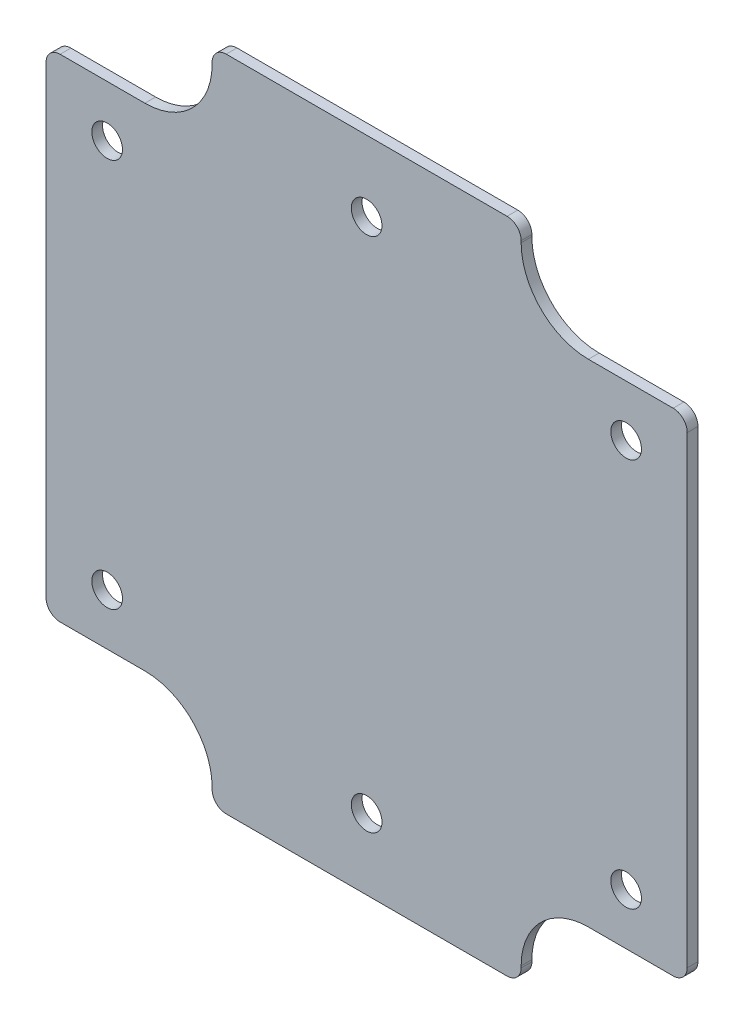
ISO-10303-21;
HEADER;
FILE_DESCRIPTION(('STEP AP214'),'2;1');
FILE_NAME('part.step','',(''),(''),'','','');
FILE_SCHEMA(('AUTOMOTIVE_DESIGN { 1 0 10303 214 1 1 1 1 }'));
ENDSEC;
DATA;
#1=APPLICATION_CONTEXT('core data for automotive mechanical design processes');
#2=APPLICATION_PROTOCOL_DEFINITION('international standard','automotive_design',2000,#1);
#3=PRODUCT_CONTEXT('',#1,'mechanical');
#4=PRODUCT('Part','Part','',(#3));
#5=PRODUCT_RELATED_PRODUCT_CATEGORY('part','',(#4));
#6=PRODUCT_DEFINITION_FORMATION('','',#4);
#7=PRODUCT_DEFINITION_CONTEXT('part definition',#1,'design');
#8=PRODUCT_DEFINITION('design','',#6,#7);
#9=PRODUCT_DEFINITION_SHAPE('','',#8);
#10=(LENGTH_UNIT() NAMED_UNIT(*) SI_UNIT(.MILLI.,.METRE.));
#11=(NAMED_UNIT(*) PLANE_ANGLE_UNIT() SI_UNIT($,.RADIAN.));
#12=(NAMED_UNIT(*) SI_UNIT($,.STERADIAN.) SOLID_ANGLE_UNIT());
#13=UNCERTAINTY_MEASURE_WITH_UNIT(LENGTH_MEASURE(1.E-05),#10,'distance_accuracy_value','');
#14=(GEOMETRIC_REPRESENTATION_CONTEXT(3) GLOBAL_UNCERTAINTY_ASSIGNED_CONTEXT((#13)) GLOBAL_UNIT_ASSIGNED_CONTEXT((#10,
#11,#12)) REPRESENTATION_CONTEXT('',''));
#15=CARTESIAN_POINT('',(0.,0.,0.));
#16=DIRECTION('',(0.,0.,1.));
#17=DIRECTION('',(1.,0.,0.));
#18=AXIS2_PLACEMENT_3D('',#15,#16,#17);
#19=CARTESIAN_POINT('',(0.,0.,1.2));
#20=DIRECTION('',(0.,0.,1.));
#21=DIRECTION('',(1.,0.,0.));
#22=AXIS2_PLACEMENT_3D('',#19,#20,#21);
#23=PLANE('',#22);
#24=CARTESIAN_POINT('',(35.8394,-28.8671,1.2));
#25=DIRECTION('',(0.,0.,1.));
#26=DIRECTION('',(1.,0.,0.));
#27=AXIS2_PLACEMENT_3D('',#24,#25,#26);
#28=CIRCLE('',#27,1.7145);
#29=CARTESIAN_POINT('',(37.5539,-28.8671,1.2));
#30=VERTEX_POINT('',#29);
#31=EDGE_CURVE('E526',#30,#30,#28,.T.);
#32=ORIENTED_EDGE('',*,*,#31,.F.);
#33=EDGE_LOOP('',(#32));
#34=FACE_BOUND('',#33,.T.);
#35=CARTESIAN_POINT('',(6.8326,21.7424,1.2));
#36=DIRECTION('',(0.,0.,1.));
#37=DIRECTION('',(1.,0.,0.));
#38=AXIS2_PLACEMENT_3D('',#35,#36,#37);
#39=CIRCLE('',#38,1.7145);
#40=CARTESIAN_POINT('',(8.5471,21.7424,1.2));
#41=VERTEX_POINT('',#40);
#42=EDGE_CURVE('E514',#41,#41,#39,.T.);
#43=ORIENTED_EDGE('',*,*,#42,.F.);
#44=EDGE_LOOP('',(#43));
#45=FACE_BOUND('',#44,.T.);
#46=CARTESIAN_POINT('',(64.8462,-21.7424,1.2));
#47=DIRECTION('',(0.,0.,1.));
#48=DIRECTION('',(1.,0.,0.));
#49=AXIS2_PLACEMENT_3D('',#46,#47,#48);
#50=CIRCLE('',#49,1.7145);
#51=CARTESIAN_POINT('',(66.5607,-21.7424,1.2));
#52=VERTEX_POINT('',#51);
#53=EDGE_CURVE('E226',#52,#52,#50,.T.);
#54=ORIENTED_EDGE('',*,*,#53,.F.);
#55=EDGE_LOOP('',(#54));
#56=FACE_BOUND('',#55,.T.);
#57=DIRECTION('',(0.,-1.,0.));
#58=VECTOR('',#57,1.);
#59=CARTESIAN_POINT('',(18.5674,-36.7792,1.2));
#60=LINE('',#59,#58);
#61=CARTESIAN_POINT('',(18.5674,-35.0012,1.2));
#62=VERTEX_POINT('',#61);
#63=CARTESIAN_POINT('',(18.5674,-35.2044,1.2));
#64=VERTEX_POINT('',#63);
#65=EDGE_CURVE('E386',#62,#64,#60,.T.);
#66=ORIENTED_EDGE('',*,*,#65,.T.);
#67=CARTESIAN_POINT('',(20.1422,-35.2044,1.2));
#68=DIRECTION('',(0.,0.,1.));
#69=DIRECTION('',(1.,0.,0.));
#70=AXIS2_PLACEMENT_3D('',#67,#68,#69);
#71=CIRCLE('',#70,1.5748);
#72=CARTESIAN_POINT('',(20.1422,-36.7792,1.2));
#73=VERTEX_POINT('',#72);
#74=EDGE_CURVE('E330',#64,#73,#71,.T.);
#75=ORIENTED_EDGE('',*,*,#74,.T.);
#76=DIRECTION('',(1.,0.,0.));
#77=VECTOR('',#76,1.);
#78=CARTESIAN_POINT('',(53.1114,-36.7792,1.2));
#79=LINE('',#78,#77);
#80=CARTESIAN_POINT('',(51.5366,-36.7792,1.2));
#81=VERTEX_POINT('',#80);
#82=EDGE_CURVE('E388',#73,#81,#79,.T.);
#83=ORIENTED_EDGE('',*,*,#82,.T.);
#84=CARTESIAN_POINT('',(51.5366,-35.2044,1.2));
#85=DIRECTION('',(0.,0.,1.));
#86=DIRECTION('',(1.,0.,0.));
#87=AXIS2_PLACEMENT_3D('',#84,#85,#86);
#88=CIRCLE('',#87,1.5748);
#89=CARTESIAN_POINT('',(53.1114,-35.2044,1.2));
#90=VERTEX_POINT('',#89);
#91=EDGE_CURVE('E328',#81,#90,#88,.T.);
#92=ORIENTED_EDGE('',*,*,#91,.T.);
#93=DIRECTION('',(0.,1.,0.));
#94=VECTOR('',#93,1.);
#95=CARTESIAN_POINT('',(53.1114,-27.4828,1.2));
#96=LINE('',#95,#94);
#97=CARTESIAN_POINT('',(53.1114,-35.0012,1.2));
#98=VERTEX_POINT('',#97);
#99=EDGE_CURVE('E218',#90,#98,#96,.T.);
#100=ORIENTED_EDGE('',*,*,#99,.T.);
#101=CARTESIAN_POINT('',(60.6298,-35.0012,1.2));
#102=DIRECTION('',(0.,0.,1.));
#103=DIRECTION('',(1.,0.,0.));
#104=AXIS2_PLACEMENT_3D('',#101,#102,#103);
#105=CIRCLE('',#104,7.5184);
#106=CARTESIAN_POINT('',(60.6298,-27.4828,1.2));
#107=VERTEX_POINT('',#106);
#108=EDGE_CURVE('E207',#98,#107,#105,.F.);
#109=ORIENTED_EDGE('',*,*,#108,.T.);
#110=DIRECTION('',(1.,0.,0.));
#111=VECTOR('',#110,1.);
#112=CARTESIAN_POINT('',(71.6788,-27.4828,1.2));
#113=LINE('',#112,#111);
#114=CARTESIAN_POINT('',(70.104,-27.4828,1.2));
#115=VERTEX_POINT('',#114);
#116=EDGE_CURVE('E217',#107,#115,#113,.T.);
#117=ORIENTED_EDGE('',*,*,#116,.T.);
#118=CARTESIAN_POINT('',(70.104,-25.908,1.2));
#119=DIRECTION('',(0.,0.,1.));
#120=DIRECTION('',(1.,0.,0.));
#121=AXIS2_PLACEMENT_3D('',#118,#119,#120);
#122=CIRCLE('',#121,1.5748);
#123=CARTESIAN_POINT('',(71.6788,-25.908,1.2));
#124=VERTEX_POINT('',#123);
#125=EDGE_CURVE('E326',#115,#124,#122,.T.);
#126=ORIENTED_EDGE('',*,*,#125,.T.);
#127=DIRECTION('',(0.,1.,0.));
#128=VECTOR('',#127,1.);
#129=CARTESIAN_POINT('',(71.6788,-27.4828,1.2));
#130=LINE('',#129,#128);
#131=CARTESIAN_POINT('',(71.6788,25.908,1.2));
#132=VERTEX_POINT('',#131);
#133=EDGE_CURVE('E504',#124,#132,#130,.T.);
#134=ORIENTED_EDGE('',*,*,#133,.T.);
#135=CARTESIAN_POINT('',(70.104,25.908,1.2));
#136=DIRECTION('',(0.,0.,1.));
#137=DIRECTION('',(1.,0.,0.));
#138=AXIS2_PLACEMENT_3D('',#135,#136,#137);
#139=CIRCLE('',#138,1.5748);
#140=CARTESIAN_POINT('',(70.104,27.4828,1.2));
#141=VERTEX_POINT('',#140);
#142=EDGE_CURVE('E324',#132,#141,#139,.T.);
#143=ORIENTED_EDGE('',*,*,#142,.T.);
#144=DIRECTION('',(-1.,0.,0.));
#145=VECTOR('',#144,1.);
#146=CARTESIAN_POINT('',(71.6788,27.4828,1.2));
#147=LINE('',#146,#145);
#148=CARTESIAN_POINT('',(60.6298,27.4828,1.2));
#149=VERTEX_POINT('',#148);
#150=EDGE_CURVE('E500',#141,#149,#147,.T.);
#151=ORIENTED_EDGE('',*,*,#150,.T.);
#152=CARTESIAN_POINT('',(60.6298,35.0012,1.2));
#153=DIRECTION('',(0.,0.,1.));
#154=DIRECTION('',(1.,0.,0.));
#155=AXIS2_PLACEMENT_3D('',#152,#153,#154);
#156=CIRCLE('',#155,7.5184);
#157=CARTESIAN_POINT('',(53.1114,35.0012,1.2));
#158=VERTEX_POINT('',#157);
#159=EDGE_CURVE('E288',#149,#158,#156,.F.);
#160=ORIENTED_EDGE('',*,*,#159,.T.);
#161=DIRECTION('',(0.,1.,0.));
#162=VECTOR('',#161,1.);
#163=CARTESIAN_POINT('',(53.1114,27.4828,1.2));
#164=LINE('',#163,#162);
#165=CARTESIAN_POINT('',(53.1114,35.2044,1.2));
#166=VERTEX_POINT('',#165);
#167=EDGE_CURVE('E497',#158,#166,#164,.T.);
#168=ORIENTED_EDGE('',*,*,#167,.T.);
#169=CARTESIAN_POINT('',(51.5366,35.2044,1.2));
#170=DIRECTION('',(0.,0.,1.));
#171=DIRECTION('',(1.,0.,0.));
#172=AXIS2_PLACEMENT_3D('',#169,#170,#171);
#173=CIRCLE('',#172,1.5748);
#174=CARTESIAN_POINT('',(51.5366,36.7792,1.2));
#175=VERTEX_POINT('',#174);
#176=EDGE_CURVE('E322',#166,#175,#173,.T.);
#177=ORIENTED_EDGE('',*,*,#176,.T.);
#178=DIRECTION('',(-1.,0.,0.));
#179=VECTOR('',#178,1.);
#180=CARTESIAN_POINT('',(53.1114,36.7792,1.2));
#181=LINE('',#180,#179);
#182=CARTESIAN_POINT('',(20.1422,36.7792,1.2));
#183=VERTEX_POINT('',#182);
#184=EDGE_CURVE('E493',#175,#183,#181,.T.);
#185=ORIENTED_EDGE('',*,*,#184,.T.);
#186=CARTESIAN_POINT('',(20.1422,35.2044,1.2));
#187=DIRECTION('',(0.,0.,1.));
#188=DIRECTION('',(1.,0.,0.));
#189=AXIS2_PLACEMENT_3D('',#186,#187,#188);
#190=CIRCLE('',#189,1.5748);
#191=CARTESIAN_POINT('',(18.5674,35.2044,1.2));
#192=VERTEX_POINT('',#191);
#193=EDGE_CURVE('E320',#183,#192,#190,.T.);
#194=ORIENTED_EDGE('',*,*,#193,.T.);
#195=DIRECTION('',(0.,-1.,0.));
#196=VECTOR('',#195,1.);
#197=CARTESIAN_POINT('',(18.5674,36.7792,1.2));
#198=LINE('',#197,#196);
#199=CARTESIAN_POINT('',(18.5674,35.0012,1.2));
#200=VERTEX_POINT('',#199);
#201=EDGE_CURVE('E372',#192,#200,#198,.T.);
#202=ORIENTED_EDGE('',*,*,#201,.T.);
#203=CARTESIAN_POINT('',(11.049,35.0012,1.2));
#204=DIRECTION('',(0.,0.,1.));
#205=DIRECTION('',(1.,0.,0.));
#206=AXIS2_PLACEMENT_3D('',#203,#204,#205);
#207=CIRCLE('',#206,7.5184);
#208=CARTESIAN_POINT('',(11.049,27.4828,1.2));
#209=VERTEX_POINT('',#208);
#210=EDGE_CURVE('E293',#200,#209,#207,.F.);
#211=ORIENTED_EDGE('',*,*,#210,.T.);
#212=DIRECTION('',(-1.,0.,0.));
#213=VECTOR('',#212,1.);
#214=CARTESIAN_POINT('',(18.5674,27.4828,1.2));
#215=LINE('',#214,#213);
#216=CARTESIAN_POINT('',(1.5748,27.4828,1.2));
#217=VERTEX_POINT('',#216);
#218=EDGE_CURVE('E363',#209,#217,#215,.T.);
#219=ORIENTED_EDGE('',*,*,#218,.T.);
#220=CARTESIAN_POINT('',(1.5748,25.908,1.2));
#221=DIRECTION('',(0.,0.,1.));
#222=DIRECTION('',(1.,0.,0.));
#223=AXIS2_PLACEMENT_3D('',#220,#221,#222);
#224=CIRCLE('',#223,1.5748);
#225=CARTESIAN_POINT('',(0.,25.908,1.2));
#226=VERTEX_POINT('',#225);
#227=EDGE_CURVE('E318',#217,#226,#224,.T.);
#228=ORIENTED_EDGE('',*,*,#227,.T.);
#229=DIRECTION('',(0.,-1.,0.));
#230=VECTOR('',#229,1.);
#231=CARTESIAN_POINT('',(0.,-27.4828,1.2));
#232=LINE('',#231,#230);
#233=CARTESIAN_POINT('',(0.,-25.908,1.2));
#234=VERTEX_POINT('',#233);
#235=EDGE_CURVE('E371',#226,#234,#232,.T.);
#236=ORIENTED_EDGE('',*,*,#235,.T.);
#237=CARTESIAN_POINT('',(1.5748,-25.908,1.2));
#238=DIRECTION('',(0.,0.,1.));
#239=DIRECTION('',(1.,0.,0.));
#240=AXIS2_PLACEMENT_3D('',#237,#238,#239);
#241=CIRCLE('',#240,1.5748);
#242=CARTESIAN_POINT('',(1.5748,-27.4828,1.2));
#243=VERTEX_POINT('',#242);
#244=EDGE_CURVE('E48',#234,#243,#241,.T.);
#245=ORIENTED_EDGE('',*,*,#244,.T.);
#246=DIRECTION('',(1.,0.,0.));
#247=VECTOR('',#246,1.);
#248=CARTESIAN_POINT('',(18.5674,-27.4828,1.2));
#249=LINE('',#248,#247);
#250=CARTESIAN_POINT('',(11.049,-27.4828,1.2));
#251=VERTEX_POINT('',#250);
#252=EDGE_CURVE('E383',#243,#251,#249,.T.);
#253=ORIENTED_EDGE('',*,*,#252,.T.);
#254=CARTESIAN_POINT('',(11.049,-35.0012,1.2));
#255=DIRECTION('',(0.,0.,1.));
#256=DIRECTION('',(1.,0.,0.));
#257=AXIS2_PLACEMENT_3D('',#254,#255,#256);
#258=CIRCLE('',#257,7.5184);
#259=EDGE_CURVE('E283',#251,#62,#258,.F.);
#260=ORIENTED_EDGE('',*,*,#259,.T.);
#261=EDGE_LOOP('',(#66,#75,#83,#92,#100,#109,#117,#126,#134,#143,#151,#160,#168,#177,#185,#194,
#202,#211,#219,#228,#236,#245,#253,#260));
#262=FACE_BOUND('',#261,.T.);
#263=CARTESIAN_POINT('',(6.83260000000001,-21.7424,1.2));
#264=DIRECTION('',(0.,0.,1.));
#265=DIRECTION('',(-1.,0.,0.));
#266=AXIS2_PLACEMENT_3D('',#263,#264,#265);
#267=CIRCLE('',#266,1.7145);
#268=CARTESIAN_POINT('',(5.11810000000001,-21.7424,1.2));
#269=VERTEX_POINT('',#268);
#270=EDGE_CURVE('E509',#269,#269,#267,.T.);
#271=ORIENTED_EDGE('',*,*,#270,.F.);
#272=EDGE_LOOP('',(#271));
#273=FACE_BOUND('',#272,.T.);
#274=CARTESIAN_POINT('',(64.8462,21.7424,1.2));
#275=DIRECTION('',(0.,0.,1.));
#276=DIRECTION('',(-1.,0.,0.));
#277=AXIS2_PLACEMENT_3D('',#274,#275,#276);
#278=CIRCLE('',#277,1.7145);
#279=CARTESIAN_POINT('',(63.1317,21.7424,1.2));
#280=VERTEX_POINT('',#279);
#281=EDGE_CURVE('E520',#280,#280,#278,.T.);
#282=ORIENTED_EDGE('',*,*,#281,.F.);
#283=EDGE_LOOP('',(#282));
#284=FACE_BOUND('',#283,.T.);
#285=CARTESIAN_POINT('',(35.8394,28.8671,1.2));
#286=DIRECTION('',(0.,0.,1.));
#287=DIRECTION('',(-1.,0.,0.));
#288=AXIS2_PLACEMENT_3D('',#285,#286,#287);
#289=CIRCLE('',#288,1.7145);
#290=CARTESIAN_POINT('',(34.1249,28.8671,1.2));
#291=VERTEX_POINT('',#290);
#292=EDGE_CURVE('E532',#291,#291,#289,.T.);
#293=ORIENTED_EDGE('',*,*,#292,.F.);
#294=EDGE_LOOP('',(#293));
#295=FACE_BOUND('',#294,.T.);
#296=ADVANCED_FACE('F33',(#34,#45,#56,#262,#273,#284,#295),#23,.T.);
#297=CARTESIAN_POINT('',(0.,0.,0.));
#298=DIRECTION('',(0.,0.,1.));
#299=DIRECTION('',(1.,0.,0.));
#300=AXIS2_PLACEMENT_3D('',#297,#298,#299);
#301=PLANE('',#300);
#302=DIRECTION('',(1.,0.,0.));
#303=VECTOR('',#302,1.);
#304=CARTESIAN_POINT('',(53.1114,-36.7792,0.));
#305=LINE('',#304,#303);
#306=CARTESIAN_POINT('',(20.1422,-36.7792,0.));
#307=VERTEX_POINT('',#306);
#308=CARTESIAN_POINT('',(51.5366,-36.7792,0.));
#309=VERTEX_POINT('',#308);
#310=EDGE_CURVE('E256',#307,#309,#305,.T.);
#311=ORIENTED_EDGE('',*,*,#310,.F.);
#312=CARTESIAN_POINT('',(20.1422,-35.2044,0.));
#313=DIRECTION('',(0.,0.,1.));
#314=DIRECTION('',(1.,0.,0.));
#315=AXIS2_PLACEMENT_3D('',#312,#313,#314);
#316=CIRCLE('',#315,1.5748);
#317=CARTESIAN_POINT('',(18.5674,-35.2044,0.));
#318=VERTEX_POINT('',#317);
#319=EDGE_CURVE('E313',#307,#318,#316,.F.);
#320=ORIENTED_EDGE('',*,*,#319,.T.);
#321=DIRECTION('',(0.,-1.,0.));
#322=VECTOR('',#321,1.);
#323=CARTESIAN_POINT('',(18.5674,-36.7792,0.));
#324=LINE('',#323,#322);
#325=CARTESIAN_POINT('',(18.5674,-35.0012,0.));
#326=VERTEX_POINT('',#325);
#327=EDGE_CURVE('E253',#326,#318,#324,.T.);
#328=ORIENTED_EDGE('',*,*,#327,.F.);
#329=CARTESIAN_POINT('',(11.049,-35.0012,0.));
#330=DIRECTION('',(0.,0.,1.));
#331=DIRECTION('',(1.,0.,0.));
#332=AXIS2_PLACEMENT_3D('',#329,#330,#331);
#333=CIRCLE('',#332,7.5184);
#334=CARTESIAN_POINT('',(11.049,-27.4828,0.));
#335=VERTEX_POINT('',#334);
#336=EDGE_CURVE('E280',#326,#335,#333,.T.);
#337=ORIENTED_EDGE('',*,*,#336,.T.);
#338=DIRECTION('',(1.,0.,0.));
#339=VECTOR('',#338,1.);
#340=CARTESIAN_POINT('',(18.5674,-27.4828,0.));
#341=LINE('',#340,#339);
#342=CARTESIAN_POINT('',(1.5748,-27.4828,0.));
#343=VERTEX_POINT('',#342);
#344=EDGE_CURVE('E251',#343,#335,#341,.T.);
#345=ORIENTED_EDGE('',*,*,#344,.F.);
#346=CARTESIAN_POINT('',(1.5748,-25.908,0.));
#347=DIRECTION('',(0.,0.,1.));
#348=DIRECTION('',(1.,0.,0.));
#349=AXIS2_PLACEMENT_3D('',#346,#347,#348);
#350=CIRCLE('',#349,1.5748);
#351=CARTESIAN_POINT('',(0.,-25.908,0.));
#352=VERTEX_POINT('',#351);
#353=EDGE_CURVE('E300',#343,#352,#350,.F.);
#354=ORIENTED_EDGE('',*,*,#353,.T.);
#355=DIRECTION('',(0.,-1.,0.));
#356=VECTOR('',#355,1.);
#357=CARTESIAN_POINT('',(0.,-27.4828,0.));
#358=LINE('',#357,#356);
#359=CARTESIAN_POINT('',(0.,25.908,0.));
#360=VERTEX_POINT('',#359);
#361=EDGE_CURVE('E249',#360,#352,#358,.T.);
#362=ORIENTED_EDGE('',*,*,#361,.F.);
#363=CARTESIAN_POINT('',(1.5748,25.908,0.));
#364=DIRECTION('',(0.,0.,1.));
#365=DIRECTION('',(1.,0.,0.));
#366=AXIS2_PLACEMENT_3D('',#363,#364,#365);
#367=CIRCLE('',#366,1.5748);
#368=CARTESIAN_POINT('',(1.5748,27.4828,0.));
#369=VERTEX_POINT('',#368);
#370=EDGE_CURVE('E302',#360,#369,#367,.F.);
#371=ORIENTED_EDGE('',*,*,#370,.T.);
#372=DIRECTION('',(-1.,0.,0.));
#373=VECTOR('',#372,1.);
#374=CARTESIAN_POINT('',(18.5674,27.4828,0.));
#375=LINE('',#374,#373);
#376=CARTESIAN_POINT('',(11.049,27.4828,0.));
#377=VERTEX_POINT('',#376);
#378=EDGE_CURVE('E246',#377,#369,#375,.T.);
#379=ORIENTED_EDGE('',*,*,#378,.F.);
#380=CARTESIAN_POINT('',(11.049,35.0012,0.));
#381=DIRECTION('',(0.,0.,1.));
#382=DIRECTION('',(1.,0.,0.));
#383=AXIS2_PLACEMENT_3D('',#380,#381,#382);
#384=CIRCLE('',#383,7.5184);
#385=CARTESIAN_POINT('',(18.5674,35.0012,0.));
#386=VERTEX_POINT('',#385);
#387=EDGE_CURVE('E290',#377,#386,#384,.T.);
#388=ORIENTED_EDGE('',*,*,#387,.T.);
#389=DIRECTION('',(0.,-1.,0.));
#390=VECTOR('',#389,1.);
#391=CARTESIAN_POINT('',(18.5674,36.7792,0.));
#392=LINE('',#391,#390);
#393=CARTESIAN_POINT('',(18.5674,35.2044,0.));
#394=VERTEX_POINT('',#393);
#395=EDGE_CURVE('E244',#394,#386,#392,.T.);
#396=ORIENTED_EDGE('',*,*,#395,.F.);
#397=CARTESIAN_POINT('',(20.1422,35.2044,0.));
#398=DIRECTION('',(0.,0.,1.));
#399=DIRECTION('',(1.,0.,0.));
#400=AXIS2_PLACEMENT_3D('',#397,#398,#399);
#401=CIRCLE('',#400,1.5748);
#402=CARTESIAN_POINT('',(20.1422,36.7792,0.));
#403=VERTEX_POINT('',#402);
#404=EDGE_CURVE('E304',#394,#403,#401,.F.);
#405=ORIENTED_EDGE('',*,*,#404,.T.);
#406=DIRECTION('',(-1.,0.,0.));
#407=VECTOR('',#406,1.);
#408=CARTESIAN_POINT('',(53.1114,36.7792,0.));
#409=LINE('',#408,#407);
#410=CARTESIAN_POINT('',(51.5366,36.7792,0.));
#411=VERTEX_POINT('',#410);
#412=EDGE_CURVE('E241',#411,#403,#409,.T.);
#413=ORIENTED_EDGE('',*,*,#412,.F.);
#414=CARTESIAN_POINT('',(51.5366,35.2044,0.));
#415=DIRECTION('',(0.,0.,1.));
#416=DIRECTION('',(1.,0.,0.));
#417=AXIS2_PLACEMENT_3D('',#414,#415,#416);
#418=CIRCLE('',#417,1.5748);
#419=CARTESIAN_POINT('',(53.1114,35.2044,0.));
#420=VERTEX_POINT('',#419);
#421=EDGE_CURVE('E306',#411,#420,#418,.F.);
#422=ORIENTED_EDGE('',*,*,#421,.T.);
#423=DIRECTION('',(0.,1.,0.));
#424=VECTOR('',#423,1.);
#425=CARTESIAN_POINT('',(53.1114,27.4828,0.));
#426=LINE('',#425,#424);
#427=CARTESIAN_POINT('',(53.1114,35.0012,0.));
#428=VERTEX_POINT('',#427);
#429=EDGE_CURVE('E238',#428,#420,#426,.T.);
#430=ORIENTED_EDGE('',*,*,#429,.F.);
#431=CARTESIAN_POINT('',(60.6298,35.0012,0.));
#432=DIRECTION('',(0.,0.,1.));
#433=DIRECTION('',(1.,0.,0.));
#434=AXIS2_PLACEMENT_3D('',#431,#432,#433);
#435=CIRCLE('',#434,7.5184);
#436=CARTESIAN_POINT('',(60.6298,27.4828,0.));
#437=VERTEX_POINT('',#436);
#438=EDGE_CURVE('E285',#428,#437,#435,.T.);
#439=ORIENTED_EDGE('',*,*,#438,.T.);
#440=DIRECTION('',(-1.,0.,0.));
#441=VECTOR('',#440,1.);
#442=CARTESIAN_POINT('',(71.6788,27.4828,0.));
#443=LINE('',#442,#441);
#444=CARTESIAN_POINT('',(70.104,27.4828,0.));
#445=VERTEX_POINT('',#444);
#446=EDGE_CURVE('E229',#445,#437,#443,.T.);
#447=ORIENTED_EDGE('',*,*,#446,.F.);
#448=CARTESIAN_POINT('',(70.104,25.908,0.));
#449=DIRECTION('',(0.,0.,1.));
#450=DIRECTION('',(1.,0.,0.));
#451=AXIS2_PLACEMENT_3D('',#448,#449,#450);
#452=CIRCLE('',#451,1.5748);
#453=CARTESIAN_POINT('',(71.6788,25.908,0.));
#454=VERTEX_POINT('',#453);
#455=EDGE_CURVE('E308',#445,#454,#452,.F.);
#456=ORIENTED_EDGE('',*,*,#455,.T.);
#457=DIRECTION('',(0.,1.,0.));
#458=VECTOR('',#457,1.);
#459=CARTESIAN_POINT('',(71.6788,-27.4828,0.));
#460=LINE('',#459,#458);
#461=CARTESIAN_POINT('',(71.6788,-25.908,0.));
#462=VERTEX_POINT('',#461);
#463=EDGE_CURVE('E225',#462,#454,#460,.T.);
#464=ORIENTED_EDGE('',*,*,#463,.F.);
#465=CARTESIAN_POINT('',(70.104,-25.908,0.));
#466=DIRECTION('',(0.,0.,1.));
#467=DIRECTION('',(1.,0.,0.));
#468=AXIS2_PLACEMENT_3D('',#465,#466,#467);
#469=CIRCLE('',#468,1.5748);
#470=CARTESIAN_POINT('',(70.104,-27.4828,0.));
#471=VERTEX_POINT('',#470);
#472=EDGE_CURVE('E224',#462,#471,#469,.F.);
#473=ORIENTED_EDGE('',*,*,#472,.T.);
#474=DIRECTION('',(1.,0.,0.));
#475=VECTOR('',#474,1.);
#476=CARTESIAN_POINT('',(71.6788,-27.4828,0.));
#477=LINE('',#476,#475);
#478=CARTESIAN_POINT('',(60.6298,-27.4828,0.));
#479=VERTEX_POINT('',#478);
#480=EDGE_CURVE('E214',#479,#471,#477,.T.);
#481=ORIENTED_EDGE('',*,*,#480,.F.);
#482=CARTESIAN_POINT('',(60.6298,-35.0012,0.));
#483=DIRECTION('',(0.,0.,1.));
#484=DIRECTION('',(1.,0.,0.));
#485=AXIS2_PLACEMENT_3D('',#482,#483,#484);
#486=CIRCLE('',#485,7.5184);
#487=CARTESIAN_POINT('',(53.1114,-35.0012,0.));
#488=VERTEX_POINT('',#487);
#489=EDGE_CURVE('E197',#479,#488,#486,.T.);
#490=ORIENTED_EDGE('',*,*,#489,.T.);
#491=DIRECTION('',(0.,1.,0.));
#492=VECTOR('',#491,1.);
#493=CARTESIAN_POINT('',(53.1114,-27.4828,0.));
#494=LINE('',#493,#492);
#495=CARTESIAN_POINT('',(53.1114,-35.2044,0.));
#496=VERTEX_POINT('',#495);
#497=EDGE_CURVE('E259',#496,#488,#494,.T.);
#498=ORIENTED_EDGE('',*,*,#497,.F.);
#499=CARTESIAN_POINT('',(51.5366,-35.2044,0.));
#500=DIRECTION('',(0.,0.,1.));
#501=DIRECTION('',(1.,0.,0.));
#502=AXIS2_PLACEMENT_3D('',#499,#500,#501);
#503=CIRCLE('',#502,1.5748);
#504=EDGE_CURVE('E311',#496,#309,#503,.F.);
#505=ORIENTED_EDGE('',*,*,#504,.T.);
#506=EDGE_LOOP('',(#311,#320,#328,#337,#345,#354,#362,#371,#379,#388,#396,#405,#413,#422,#430,
#439,#447,#456,#464,#473,#481,#490,#498,#505));
#507=FACE_BOUND('',#506,.T.);
#508=CARTESIAN_POINT('',(64.8462,-21.7424,0.));
#509=DIRECTION('',(0.,0.,1.));
#510=DIRECTION('',(1.,0.,0.));
#511=AXIS2_PLACEMENT_3D('',#508,#509,#510);
#512=CIRCLE('',#511,1.7145);
#513=CARTESIAN_POINT('',(66.5607,-21.7424,0.));
#514=VERTEX_POINT('',#513);
#515=EDGE_CURVE('E232',#514,#514,#512,.T.);
#516=ORIENTED_EDGE('',*,*,#515,.T.);
#517=EDGE_LOOP('',(#516));
#518=FACE_BOUND('',#517,.T.);
#519=CARTESIAN_POINT('',(6.83260000000001,-21.7424,0.));
#520=DIRECTION('',(0.,0.,1.));
#521=DIRECTION('',(-1.,0.,0.));
#522=AXIS2_PLACEMENT_3D('',#519,#520,#521);
#523=CIRCLE('',#522,1.7145);
#524=CARTESIAN_POINT('',(5.11810000000001,-21.7424,0.));
#525=VERTEX_POINT('',#524);
#526=EDGE_CURVE('E511',#525,#525,#523,.T.);
#527=ORIENTED_EDGE('',*,*,#526,.T.);
#528=EDGE_LOOP('',(#527));
#529=FACE_BOUND('',#528,.T.);
#530=CARTESIAN_POINT('',(6.8326,21.7424,0.));
#531=DIRECTION('',(0.,0.,1.));
#532=DIRECTION('',(1.,0.,0.));
#533=AXIS2_PLACEMENT_3D('',#530,#531,#532);
#534=CIRCLE('',#533,1.7145);
#535=CARTESIAN_POINT('',(8.5471,21.7424,0.));
#536=VERTEX_POINT('',#535);
#537=EDGE_CURVE('E517',#536,#536,#534,.T.);
#538=ORIENTED_EDGE('',*,*,#537,.T.);
#539=EDGE_LOOP('',(#538));
#540=FACE_BOUND('',#539,.T.);
#541=CARTESIAN_POINT('',(64.8462,21.7424,0.));
#542=DIRECTION('',(0.,0.,1.));
#543=DIRECTION('',(-1.,0.,0.));
#544=AXIS2_PLACEMENT_3D('',#541,#542,#543);
#545=CIRCLE('',#544,1.7145);
#546=CARTESIAN_POINT('',(63.1317,21.7424,0.));
#547=VERTEX_POINT('',#546);
#548=EDGE_CURVE('E523',#547,#547,#545,.T.);
#549=ORIENTED_EDGE('',*,*,#548,.T.);
#550=EDGE_LOOP('',(#549));
#551=FACE_BOUND('',#550,.T.);
#552=CARTESIAN_POINT('',(35.8394,-28.8671,0.));
#553=DIRECTION('',(0.,0.,1.));
#554=DIRECTION('',(1.,0.,0.));
#555=AXIS2_PLACEMENT_3D('',#552,#553,#554);
#556=CIRCLE('',#555,1.7145);
#557=CARTESIAN_POINT('',(37.5539,-28.8671,0.));
#558=VERTEX_POINT('',#557);
#559=EDGE_CURVE('E529',#558,#558,#556,.T.);
#560=ORIENTED_EDGE('',*,*,#559,.T.);
#561=EDGE_LOOP('',(#560));
#562=FACE_BOUND('',#561,.T.);
#563=CARTESIAN_POINT('',(35.8394,28.8671,0.));
#564=DIRECTION('',(0.,0.,1.));
#565=DIRECTION('',(-1.,0.,0.));
#566=AXIS2_PLACEMENT_3D('',#563,#564,#565);
#567=CIRCLE('',#566,1.7145);
#568=CARTESIAN_POINT('',(34.1249,28.8671,0.));
#569=VERTEX_POINT('',#568);
#570=EDGE_CURVE('E535',#569,#569,#567,.T.);
#571=ORIENTED_EDGE('',*,*,#570,.T.);
#572=EDGE_LOOP('',(#571));
#573=FACE_BOUND('',#572,.T.);
#574=ADVANCED_FACE('F221',(#507,#518,#529,#540,#551,#562,#573),#301,.F.);
#575=CARTESIAN_POINT('',(71.6788,-27.4828,1.2));
#576=DIRECTION('',(0.,1.,0.));
#577=DIRECTION('',(-1.,0.,0.));
#578=AXIS2_PLACEMENT_3D('',#575,#576,#577);
#579=PLANE('',#578);
#580=ORIENTED_EDGE('',*,*,#480,.T.);
#581=DIRECTION('',(0.,0.,-1.));
#582=VECTOR('',#581,1.);
#583=CARTESIAN_POINT('',(70.104,-27.4828,1.2));
#584=LINE('',#583,#582);
#585=EDGE_CURVE('E340',#471,#115,#584,.F.);
#586=ORIENTED_EDGE('',*,*,#585,.T.);
#587=ORIENTED_EDGE('',*,*,#116,.F.);
#588=DIRECTION('',(0.,0.,-1.));
#589=VECTOR('',#588,1.);
#590=CARTESIAN_POINT('',(60.6298,-27.4828,0.));
#591=LINE('',#590,#589);
#592=EDGE_CURVE('E201',#107,#479,#591,.T.);
#593=ORIENTED_EDGE('',*,*,#592,.T.);
#594=EDGE_LOOP('',(#580,#586,#587,#593));
#595=FACE_BOUND('',#594,.T.);
#596=ADVANCED_FACE('F213',(#595),#579,.F.);
#597=CARTESIAN_POINT('',(71.6788,-27.4828,1.2));
#598=DIRECTION('',(-1.,0.,0.));
#599=DIRECTION('',(0.,0.,1.));
#600=AXIS2_PLACEMENT_3D('',#597,#598,#599);
#601=PLANE('',#600);
#602=ORIENTED_EDGE('',*,*,#133,.F.);
#603=DIRECTION('',(0.,0.,-1.));
#604=VECTOR('',#603,1.);
#605=CARTESIAN_POINT('',(71.6788,-25.908,1.2));
#606=LINE('',#605,#604);
#607=EDGE_CURVE('E337',#124,#462,#606,.T.);
#608=ORIENTED_EDGE('',*,*,#607,.T.);
#609=ORIENTED_EDGE('',*,*,#463,.T.);
#610=DIRECTION('',(0.,0.,-1.));
#611=VECTOR('',#610,1.);
#612=CARTESIAN_POINT('',(71.6788,25.908,1.2));
#613=LINE('',#612,#611);
#614=EDGE_CURVE('E335',#454,#132,#613,.F.);
#615=ORIENTED_EDGE('',*,*,#614,.T.);
#616=EDGE_LOOP('',(#602,#608,#609,#615));
#617=FACE_BOUND('',#616,.T.);
#618=ADVANCED_FACE('F460',(#617),#601,.F.);
#619=CARTESIAN_POINT('',(71.6788,27.4828,1.2));
#620=DIRECTION('',(0.,-1.,0.));
#621=DIRECTION('',(1.,0.,0.));
#622=AXIS2_PLACEMENT_3D('',#619,#620,#621);
#623=PLANE('',#622);
#624=ORIENTED_EDGE('',*,*,#150,.F.);
#625=DIRECTION('',(0.,0.,-1.));
#626=VECTOR('',#625,1.);
#627=CARTESIAN_POINT('',(70.104,27.4828,1.2));
#628=LINE('',#627,#626);
#629=EDGE_CURVE('E342',#141,#445,#628,.T.);
#630=ORIENTED_EDGE('',*,*,#629,.T.);
#631=ORIENTED_EDGE('',*,*,#446,.T.);
#632=DIRECTION('',(0.,0.,-1.));
#633=VECTOR('',#632,1.);
#634=CARTESIAN_POINT('',(60.6298,27.4828,1.2));
#635=LINE('',#634,#633);
#636=EDGE_CURVE('E271',#437,#149,#635,.F.);
#637=ORIENTED_EDGE('',*,*,#636,.T.);
#638=EDGE_LOOP('',(#624,#630,#631,#637));
#639=FACE_BOUND('',#638,.T.);
#640=ADVANCED_FACE('F456',(#639),#623,.F.);
#641=CARTESIAN_POINT('',(53.1114,27.4828,1.2));
#642=DIRECTION('',(-1.,0.,0.));
#643=DIRECTION('',(0.,0.,1.));
#644=AXIS2_PLACEMENT_3D('',#641,#642,#643);
#645=PLANE('',#644);
#646=ORIENTED_EDGE('',*,*,#429,.T.);
#647=DIRECTION('',(0.,0.,-1.));
#648=VECTOR('',#647,1.);
#649=CARTESIAN_POINT('',(53.1114,35.2044,1.2));
#650=LINE('',#649,#648);
#651=EDGE_CURVE('E350',#420,#166,#650,.F.);
#652=ORIENTED_EDGE('',*,*,#651,.T.);
#653=ORIENTED_EDGE('',*,*,#167,.F.);
#654=DIRECTION('',(0.,0.,-1.));
#655=VECTOR('',#654,1.);
#656=CARTESIAN_POINT('',(53.1114,35.0012,0.));
#657=LINE('',#656,#655);
#658=EDGE_CURVE('E268',#158,#428,#657,.T.);
#659=ORIENTED_EDGE('',*,*,#658,.T.);
#660=EDGE_LOOP('',(#646,#652,#653,#659));
#661=FACE_BOUND('',#660,.T.);
#662=ADVANCED_FACE('F452',(#661),#645,.F.);
#663=CARTESIAN_POINT('',(53.1114,36.7792,1.2));
#664=DIRECTION('',(0.,-1.,0.));
#665=DIRECTION('',(0.,0.,-1.));
#666=AXIS2_PLACEMENT_3D('',#663,#664,#665);
#667=PLANE('',#666);
#668=ORIENTED_EDGE('',*,*,#184,.F.);
#669=DIRECTION('',(0.,0.,-1.));
#670=VECTOR('',#669,1.);
#671=CARTESIAN_POINT('',(51.5366,36.7792,1.2));
#672=LINE('',#671,#670);
#673=EDGE_CURVE('E347',#175,#411,#672,.T.);
#674=ORIENTED_EDGE('',*,*,#673,.T.);
#675=ORIENTED_EDGE('',*,*,#412,.T.);
#676=DIRECTION('',(0.,0.,-1.));
#677=VECTOR('',#676,1.);
#678=CARTESIAN_POINT('',(20.1422,36.7792,1.2));
#679=LINE('',#678,#677);
#680=EDGE_CURVE('E345',#403,#183,#679,.F.);
#681=ORIENTED_EDGE('',*,*,#680,.T.);
#682=EDGE_LOOP('',(#668,#674,#675,#681));
#683=FACE_BOUND('',#682,.T.);
#684=ADVANCED_FACE('F448',(#683),#667,.F.);
#685=CARTESIAN_POINT('',(18.5674,36.7792,1.2));
#686=DIRECTION('',(1.,0.,0.));
#687=DIRECTION('',(0.,0.,-1.));
#688=AXIS2_PLACEMENT_3D('',#685,#686,#687);
#689=PLANE('',#688);
#690=ORIENTED_EDGE('',*,*,#201,.F.);
#691=DIRECTION('',(0.,0.,-1.));
#692=VECTOR('',#691,1.);
#693=CARTESIAN_POINT('',(18.5674,35.2044,1.2));
#694=LINE('',#693,#692);
#695=EDGE_CURVE('E352',#192,#394,#694,.T.);
#696=ORIENTED_EDGE('',*,*,#695,.T.);
#697=ORIENTED_EDGE('',*,*,#395,.T.);
#698=DIRECTION('',(0.,0.,-1.));
#699=VECTOR('',#698,1.);
#700=CARTESIAN_POINT('',(18.5674,35.0012,1.2));
#701=LINE('',#700,#699);
#702=EDGE_CURVE('E208',#386,#200,#701,.F.);
#703=ORIENTED_EDGE('',*,*,#702,.T.);
#704=EDGE_LOOP('',(#690,#696,#697,#703));
#705=FACE_BOUND('',#704,.T.);
#706=ADVANCED_FACE('F445',(#705),#689,.F.);
#707=CARTESIAN_POINT('',(18.5674,27.4828,1.2));
#708=DIRECTION('',(0.,-1.,0.));
#709=DIRECTION('',(1.,0.,0.));
#710=AXIS2_PLACEMENT_3D('',#707,#708,#709);
#711=PLANE('',#710);
#712=ORIENTED_EDGE('',*,*,#378,.T.);
#713=DIRECTION('',(0.,0.,-1.));
#714=VECTOR('',#713,1.);
#715=CARTESIAN_POINT('',(1.5748,27.4828,1.2));
#716=LINE('',#715,#714);
#717=EDGE_CURVE('E41',#369,#217,#716,.F.);
#718=ORIENTED_EDGE('',*,*,#717,.T.);
#719=ORIENTED_EDGE('',*,*,#218,.F.);
#720=DIRECTION('',(0.,0.,-1.));
#721=VECTOR('',#720,1.);
#722=CARTESIAN_POINT('',(11.049,27.4828,0.));
#723=LINE('',#722,#721);
#724=EDGE_CURVE('E274',#209,#377,#723,.T.);
#725=ORIENTED_EDGE('',*,*,#724,.T.);
#726=EDGE_LOOP('',(#712,#718,#719,#725));
#727=FACE_BOUND('',#726,.T.);
#728=ADVANCED_FACE('F362',(#727),#711,.F.);
#729=CARTESIAN_POINT('',(0.,-27.4828,1.2));
#730=DIRECTION('',(1.,0.,0.));
#731=DIRECTION('',(0.,0.,-1.));
#732=AXIS2_PLACEMENT_3D('',#729,#730,#731);
#733=PLANE('',#732);
#734=ORIENTED_EDGE('',*,*,#235,.F.);
#735=DIRECTION('',(0.,0.,-1.));
#736=VECTOR('',#735,1.);
#737=CARTESIAN_POINT('',(0.,25.908,1.2));
#738=LINE('',#737,#736);
#739=EDGE_CURVE('E356',#226,#360,#738,.T.);
#740=ORIENTED_EDGE('',*,*,#739,.T.);
#741=ORIENTED_EDGE('',*,*,#361,.T.);
#742=DIRECTION('',(0.,0.,-1.));
#743=VECTOR('',#742,1.);
#744=CARTESIAN_POINT('',(0.,-25.908,1.2));
#745=LINE('',#744,#743);
#746=EDGE_CURVE('E56',#352,#234,#745,.F.);
#747=ORIENTED_EDGE('',*,*,#746,.T.);
#748=EDGE_LOOP('',(#734,#740,#741,#747));
#749=FACE_BOUND('',#748,.T.);
#750=ADVANCED_FACE('F377',(#749),#733,.F.);
#751=CARTESIAN_POINT('',(18.5674,-27.4828,1.2));
#752=DIRECTION('',(0.,1.,0.));
#753=DIRECTION('',(-1.,0.,0.));
#754=AXIS2_PLACEMENT_3D('',#751,#752,#753);
#755=PLANE('',#754);
#756=ORIENTED_EDGE('',*,*,#252,.F.);
#757=DIRECTION('',(0.,0.,-1.));
#758=VECTOR('',#757,1.);
#759=CARTESIAN_POINT('',(1.5748,-27.4828,1.2));
#760=LINE('',#759,#758);
#761=EDGE_CURVE('E11',#243,#343,#760,.T.);
#762=ORIENTED_EDGE('',*,*,#761,.T.);
#763=ORIENTED_EDGE('',*,*,#344,.T.);
#764=DIRECTION('',(0.,0.,-1.));
#765=VECTOR('',#764,1.);
#766=CARTESIAN_POINT('',(11.049,-27.4828,1.2));
#767=LINE('',#766,#765);
#768=EDGE_CURVE('E265',#335,#251,#767,.F.);
#769=ORIENTED_EDGE('',*,*,#768,.T.);
#770=EDGE_LOOP('',(#756,#762,#763,#769));
#771=FACE_BOUND('',#770,.T.);
#772=ADVANCED_FACE('F382',(#771),#755,.F.);
#773=CARTESIAN_POINT('',(18.5674,-36.7792,1.2));
#774=DIRECTION('',(1.,0.,0.));
#775=DIRECTION('',(0.,0.,-1.));
#776=AXIS2_PLACEMENT_3D('',#773,#774,#775);
#777=PLANE('',#776);
#778=ORIENTED_EDGE('',*,*,#327,.T.);
#779=DIRECTION('',(0.,0.,-1.));
#780=VECTOR('',#779,1.);
#781=CARTESIAN_POINT('',(18.5674,-35.2044,1.2));
#782=LINE('',#781,#780);
#783=EDGE_CURVE('E315',#318,#64,#782,.F.);
#784=ORIENTED_EDGE('',*,*,#783,.T.);
#785=ORIENTED_EDGE('',*,*,#65,.F.);
#786=DIRECTION('',(0.,0.,-1.));
#787=VECTOR('',#786,1.);
#788=CARTESIAN_POINT('',(18.5674,-35.0012,0.));
#789=LINE('',#788,#787);
#790=EDGE_CURVE('E262',#62,#326,#789,.T.);
#791=ORIENTED_EDGE('',*,*,#790,.T.);
#792=EDGE_LOOP('',(#778,#784,#785,#791));
#793=FACE_BOUND('',#792,.T.);
#794=ADVANCED_FACE('F435',(#793),#777,.F.);
#795=CARTESIAN_POINT('',(53.1114,-36.7792,1.2));
#796=DIRECTION('',(0.,1.,0.));
#797=DIRECTION('',(0.,0.,1.));
#798=AXIS2_PLACEMENT_3D('',#795,#796,#797);
#799=PLANE('',#798);
#800=ORIENTED_EDGE('',*,*,#82,.F.);
#801=DIRECTION('',(0.,0.,-1.));
#802=VECTOR('',#801,1.);
#803=CARTESIAN_POINT('',(20.1422,-36.7792,1.2));
#804=LINE('',#803,#802);
#805=EDGE_CURVE('E297',#73,#307,#804,.T.);
#806=ORIENTED_EDGE('',*,*,#805,.T.);
#807=ORIENTED_EDGE('',*,*,#310,.T.);
#808=DIRECTION('',(0.,0.,-1.));
#809=VECTOR('',#808,1.);
#810=CARTESIAN_POINT('',(51.5366,-36.7792,1.2));
#811=LINE('',#810,#809);
#812=EDGE_CURVE('E295',#309,#81,#811,.F.);
#813=ORIENTED_EDGE('',*,*,#812,.T.);
#814=EDGE_LOOP('',(#800,#806,#807,#813));
#815=FACE_BOUND('',#814,.T.);
#816=ADVANCED_FACE('F401',(#815),#799,.F.);
#817=CARTESIAN_POINT('',(53.1114,-27.4828,1.2));
#818=DIRECTION('',(-1.,0.,0.));
#819=DIRECTION('',(0.,0.,1.));
#820=AXIS2_PLACEMENT_3D('',#817,#818,#819);
#821=PLANE('',#820);
#822=ORIENTED_EDGE('',*,*,#99,.F.);
#823=DIRECTION('',(0.,0.,-1.));
#824=VECTOR('',#823,1.);
#825=CARTESIAN_POINT('',(53.1114,-35.2044,1.2));
#826=LINE('',#825,#824);
#827=EDGE_CURVE('E332',#90,#496,#826,.T.);
#828=ORIENTED_EDGE('',*,*,#827,.T.);
#829=ORIENTED_EDGE('',*,*,#497,.T.);
#830=DIRECTION('',(0.,0.,-1.));
#831=VECTOR('',#830,1.);
#832=CARTESIAN_POINT('',(53.1114,-35.0012,1.2));
#833=LINE('',#832,#831);
#834=EDGE_CURVE('E203',#488,#98,#833,.F.);
#835=ORIENTED_EDGE('',*,*,#834,.T.);
#836=EDGE_LOOP('',(#822,#828,#829,#835));
#837=FACE_BOUND('',#836,.T.);
#838=ADVANCED_FACE('F397',(#837),#821,.F.);
#839=CARTESIAN_POINT('',(64.8462,-21.7424,1.2));
#840=DIRECTION('',(0.,0.,-1.));
#841=DIRECTION('',(-1.,0.,0.));
#842=AXIS2_PLACEMENT_3D('',#839,#840,#841);
#843=CYLINDRICAL_SURFACE('',#842,1.7145);
#844=ORIENTED_EDGE('',*,*,#53,.T.);
#845=EDGE_LOOP('',(#844));
#846=FACE_BOUND('',#845,.T.);
#847=ORIENTED_EDGE('',*,*,#515,.F.);
#848=EDGE_LOOP('',(#847));
#849=FACE_BOUND('',#848,.T.);
#850=ADVANCED_FACE('F428',(#846,#849),#843,.F.);
#851=CARTESIAN_POINT('',(6.83260000000001,-21.7424,1.2));
#852=DIRECTION('',(0.,0.,-1.));
#853=DIRECTION('',(-1.,0.,0.));
#854=AXIS2_PLACEMENT_3D('',#851,#852,#853);
#855=CYLINDRICAL_SURFACE('',#854,1.7145);
#856=ORIENTED_EDGE('',*,*,#270,.T.);
#857=EDGE_LOOP('',(#856));
#858=FACE_BOUND('',#857,.T.);
#859=ORIENTED_EDGE('',*,*,#526,.F.);
#860=EDGE_LOOP('',(#859));
#861=FACE_BOUND('',#860,.T.);
#862=ADVANCED_FACE('F560',(#858,#861),#855,.F.);
#863=CARTESIAN_POINT('',(6.8326,21.7424,1.2));
#864=DIRECTION('',(0.,0.,-1.));
#865=DIRECTION('',(-1.,0.,0.));
#866=AXIS2_PLACEMENT_3D('',#863,#864,#865);
#867=CYLINDRICAL_SURFACE('',#866,1.7145);
#868=ORIENTED_EDGE('',*,*,#42,.T.);
#869=EDGE_LOOP('',(#868));
#870=FACE_BOUND('',#869,.T.);
#871=ORIENTED_EDGE('',*,*,#537,.F.);
#872=EDGE_LOOP('',(#871));
#873=FACE_BOUND('',#872,.T.);
#874=ADVANCED_FACE('F557',(#870,#873),#867,.F.);
#875=CARTESIAN_POINT('',(64.8462,21.7424,1.2));
#876=DIRECTION('',(0.,0.,-1.));
#877=DIRECTION('',(-1.,0.,0.));
#878=AXIS2_PLACEMENT_3D('',#875,#876,#877);
#879=CYLINDRICAL_SURFACE('',#878,1.7145);
#880=ORIENTED_EDGE('',*,*,#281,.T.);
#881=EDGE_LOOP('',(#880));
#882=FACE_BOUND('',#881,.T.);
#883=ORIENTED_EDGE('',*,*,#548,.F.);
#884=EDGE_LOOP('',(#883));
#885=FACE_BOUND('',#884,.T.);
#886=ADVANCED_FACE('F551',(#882,#885),#879,.F.);
#887=CARTESIAN_POINT('',(35.8394,-28.8671,1.2));
#888=DIRECTION('',(0.,0.,-1.));
#889=DIRECTION('',(-1.,0.,0.));
#890=AXIS2_PLACEMENT_3D('',#887,#888,#889);
#891=CYLINDRICAL_SURFACE('',#890,1.7145);
#892=ORIENTED_EDGE('',*,*,#31,.T.);
#893=EDGE_LOOP('',(#892));
#894=FACE_BOUND('',#893,.T.);
#895=ORIENTED_EDGE('',*,*,#559,.F.);
#896=EDGE_LOOP('',(#895));
#897=FACE_BOUND('',#896,.T.);
#898=ADVANCED_FACE('F544',(#894,#897),#891,.F.);
#899=CARTESIAN_POINT('',(35.8394,28.8671,1.2));
#900=DIRECTION('',(0.,0.,-1.));
#901=DIRECTION('',(-1.,0.,0.));
#902=AXIS2_PLACEMENT_3D('',#899,#900,#901);
#903=CYLINDRICAL_SURFACE('',#902,1.7145);
#904=ORIENTED_EDGE('',*,*,#292,.T.);
#905=EDGE_LOOP('',(#904));
#906=FACE_BOUND('',#905,.T.);
#907=ORIENTED_EDGE('',*,*,#570,.F.);
#908=EDGE_LOOP('',(#907));
#909=FACE_BOUND('',#908,.T.);
#910=ADVANCED_FACE('F470',(#906,#909),#903,.F.);
#911=CARTESIAN_POINT('',(60.6298,-35.0012,1.2));
#912=DIRECTION('',(0.,0.,1.));
#913=DIRECTION('',(1.,0.,0.));
#914=AXIS2_PLACEMENT_3D('',#911,#912,#913);
#915=CYLINDRICAL_SURFACE('',#914,7.5184);
#916=ORIENTED_EDGE('',*,*,#108,.F.);
#917=ORIENTED_EDGE('',*,*,#834,.F.);
#918=ORIENTED_EDGE('',*,*,#489,.F.);
#919=ORIENTED_EDGE('',*,*,#592,.F.);
#920=EDGE_LOOP('',(#916,#917,#918,#919));
#921=FACE_BOUND('',#920,.T.);
#922=ADVANCED_FACE('F200',(#921),#915,.F.);
#923=CARTESIAN_POINT('',(11.049,-35.0012,1.2));
#924=DIRECTION('',(0.,0.,1.));
#925=DIRECTION('',(1.,0.,0.));
#926=AXIS2_PLACEMENT_3D('',#923,#924,#925);
#927=CYLINDRICAL_SURFACE('',#926,7.5184);
#928=ORIENTED_EDGE('',*,*,#259,.F.);
#929=ORIENTED_EDGE('',*,*,#768,.F.);
#930=ORIENTED_EDGE('',*,*,#336,.F.);
#931=ORIENTED_EDGE('',*,*,#790,.F.);
#932=EDGE_LOOP('',(#928,#929,#930,#931));
#933=FACE_BOUND('',#932,.T.);
#934=ADVANCED_FACE('F469',(#933),#927,.F.);
#935=CARTESIAN_POINT('',(60.6298,35.0012,1.2));
#936=DIRECTION('',(0.,0.,1.));
#937=DIRECTION('',(1.,0.,0.));
#938=AXIS2_PLACEMENT_3D('',#935,#936,#937);
#939=CYLINDRICAL_SURFACE('',#938,7.5184);
#940=ORIENTED_EDGE('',*,*,#159,.F.);
#941=ORIENTED_EDGE('',*,*,#636,.F.);
#942=ORIENTED_EDGE('',*,*,#438,.F.);
#943=ORIENTED_EDGE('',*,*,#658,.F.);
#944=EDGE_LOOP('',(#940,#941,#942,#943));
#945=FACE_BOUND('',#944,.T.);
#946=ADVANCED_FACE('F473',(#945),#939,.F.);
#947=CARTESIAN_POINT('',(11.049,35.0012,1.2));
#948=DIRECTION('',(0.,0.,1.));
#949=DIRECTION('',(1.,0.,0.));
#950=AXIS2_PLACEMENT_3D('',#947,#948,#949);
#951=CYLINDRICAL_SURFACE('',#950,7.5184);
#952=ORIENTED_EDGE('',*,*,#210,.F.);
#953=ORIENTED_EDGE('',*,*,#702,.F.);
#954=ORIENTED_EDGE('',*,*,#387,.F.);
#955=ORIENTED_EDGE('',*,*,#724,.F.);
#956=EDGE_LOOP('',(#952,#953,#954,#955));
#957=FACE_BOUND('',#956,.T.);
#958=ADVANCED_FACE('F415',(#957),#951,.F.);
#959=CARTESIAN_POINT('',(20.1422,-35.2044,1.2));
#960=DIRECTION('',(0.,0.,-1.));
#961=DIRECTION('',(-1.,0.,0.));
#962=AXIS2_PLACEMENT_3D('',#959,#960,#961);
#963=CYLINDRICAL_SURFACE('',#962,1.5748);
#964=ORIENTED_EDGE('',*,*,#74,.F.);
#965=ORIENTED_EDGE('',*,*,#783,.F.);
#966=ORIENTED_EDGE('',*,*,#319,.F.);
#967=ORIENTED_EDGE('',*,*,#805,.F.);
#968=EDGE_LOOP('',(#964,#965,#966,#967));
#969=FACE_BOUND('',#968,.T.);
#970=ADVANCED_FACE('F406',(#969),#963,.T.);
#971=CARTESIAN_POINT('',(51.5366,-35.2044,1.2));
#972=DIRECTION('',(0.,0.,-1.));
#973=DIRECTION('',(-1.,0.,0.));
#974=AXIS2_PLACEMENT_3D('',#971,#972,#973);
#975=CYLINDRICAL_SURFACE('',#974,1.5748);
#976=ORIENTED_EDGE('',*,*,#91,.F.);
#977=ORIENTED_EDGE('',*,*,#812,.F.);
#978=ORIENTED_EDGE('',*,*,#504,.F.);
#979=ORIENTED_EDGE('',*,*,#827,.F.);
#980=EDGE_LOOP('',(#976,#977,#978,#979));
#981=FACE_BOUND('',#980,.T.);
#982=ADVANCED_FACE('F403',(#981),#975,.T.);
#983=CARTESIAN_POINT('',(70.104,-25.908,1.2));
#984=DIRECTION('',(0.,0.,-1.));
#985=DIRECTION('',(-1.,0.,0.));
#986=AXIS2_PLACEMENT_3D('',#983,#984,#985);
#987=CYLINDRICAL_SURFACE('',#986,1.5748);
#988=ORIENTED_EDGE('',*,*,#125,.F.);
#989=ORIENTED_EDGE('',*,*,#585,.F.);
#990=ORIENTED_EDGE('',*,*,#472,.F.);
#991=ORIENTED_EDGE('',*,*,#607,.F.);
#992=EDGE_LOOP('',(#988,#989,#990,#991));
#993=FACE_BOUND('',#992,.T.);
#994=ADVANCED_FACE('F405',(#993),#987,.T.);
#995=CARTESIAN_POINT('',(70.104,25.908,1.2));
#996=DIRECTION('',(0.,0.,-1.));
#997=DIRECTION('',(-1.,0.,0.));
#998=AXIS2_PLACEMENT_3D('',#995,#996,#997);
#999=CYLINDRICAL_SURFACE('',#998,1.5748);
#1000=ORIENTED_EDGE('',*,*,#142,.F.);
#1001=ORIENTED_EDGE('',*,*,#614,.F.);
#1002=ORIENTED_EDGE('',*,*,#455,.F.);
#1003=ORIENTED_EDGE('',*,*,#629,.F.);
#1004=EDGE_LOOP('',(#1000,#1001,#1002,#1003));
#1005=FACE_BOUND('',#1004,.T.);
#1006=ADVANCED_FACE('F412',(#1005),#999,.T.);
#1007=CARTESIAN_POINT('',(51.5366,35.2044,1.2));
#1008=DIRECTION('',(0.,0.,-1.));
#1009=DIRECTION('',(-1.,0.,0.));
#1010=AXIS2_PLACEMENT_3D('',#1007,#1008,#1009);
#1011=CYLINDRICAL_SURFACE('',#1010,1.5748);
#1012=ORIENTED_EDGE('',*,*,#176,.F.);
#1013=ORIENTED_EDGE('',*,*,#651,.F.);
#1014=ORIENTED_EDGE('',*,*,#421,.F.);
#1015=ORIENTED_EDGE('',*,*,#673,.F.);
#1016=EDGE_LOOP('',(#1012,#1013,#1014,#1015));
#1017=FACE_BOUND('',#1016,.T.);
#1018=ADVANCED_FACE('F743',(#1017),#1011,.T.);
#1019=CARTESIAN_POINT('',(20.1422,35.2044,1.2));
#1020=DIRECTION('',(0.,0.,-1.));
#1021=DIRECTION('',(-1.,0.,0.));
#1022=AXIS2_PLACEMENT_3D('',#1019,#1020,#1021);
#1023=CYLINDRICAL_SURFACE('',#1022,1.5748);
#1024=ORIENTED_EDGE('',*,*,#193,.F.);
#1025=ORIENTED_EDGE('',*,*,#680,.F.);
#1026=ORIENTED_EDGE('',*,*,#404,.F.);
#1027=ORIENTED_EDGE('',*,*,#695,.F.);
#1028=EDGE_LOOP('',(#1024,#1025,#1026,#1027));
#1029=FACE_BOUND('',#1028,.T.);
#1030=ADVANCED_FACE('F489',(#1029),#1023,.T.);
#1031=CARTESIAN_POINT('',(1.5748,25.908,1.2));
#1032=DIRECTION('',(0.,0.,-1.));
#1033=DIRECTION('',(-1.,0.,0.));
#1034=AXIS2_PLACEMENT_3D('',#1031,#1032,#1033);
#1035=CYLINDRICAL_SURFACE('',#1034,1.5748);
#1036=ORIENTED_EDGE('',*,*,#227,.F.);
#1037=ORIENTED_EDGE('',*,*,#717,.F.);
#1038=ORIENTED_EDGE('',*,*,#370,.F.);
#1039=ORIENTED_EDGE('',*,*,#739,.F.);
#1040=EDGE_LOOP('',(#1036,#1037,#1038,#1039));
#1041=FACE_BOUND('',#1040,.T.);
#1042=ADVANCED_FACE('F375',(#1041),#1035,.T.);
#1043=CARTESIAN_POINT('',(1.5748,-25.908,1.2));
#1044=DIRECTION('',(0.,0.,-1.));
#1045=DIRECTION('',(-1.,0.,0.));
#1046=AXIS2_PLACEMENT_3D('',#1043,#1044,#1045);
#1047=CYLINDRICAL_SURFACE('',#1046,1.5748);
#1048=ORIENTED_EDGE('',*,*,#244,.F.);
#1049=ORIENTED_EDGE('',*,*,#746,.F.);
#1050=ORIENTED_EDGE('',*,*,#353,.F.);
#1051=ORIENTED_EDGE('',*,*,#761,.F.);
#1052=EDGE_LOOP('',(#1048,#1049,#1050,#1051));
#1053=FACE_BOUND('',#1052,.T.);
#1054=ADVANCED_FACE('F35',(#1053),#1047,.T.);
#1055=CLOSED_SHELL('',(#296,#574,#596,#618,#640,#662,#684,#706,#728,#750,#772,#794,#816,#838,
#850,#862,#874,#886,#898,#910,#922,#934,#946,#958,#970,#982,#994,#1006,#1018,#1030,#1042,#1054));
#1056=MANIFOLD_SOLID_BREP('B2',#1055);
#1057=ADVANCED_BREP_SHAPE_REPRESENTATION('',(#18,#1056),#14);
#1058=SHAPE_DEFINITION_REPRESENTATION(#9,#1057);
ENDSEC;
END-ISO-10303-21;
